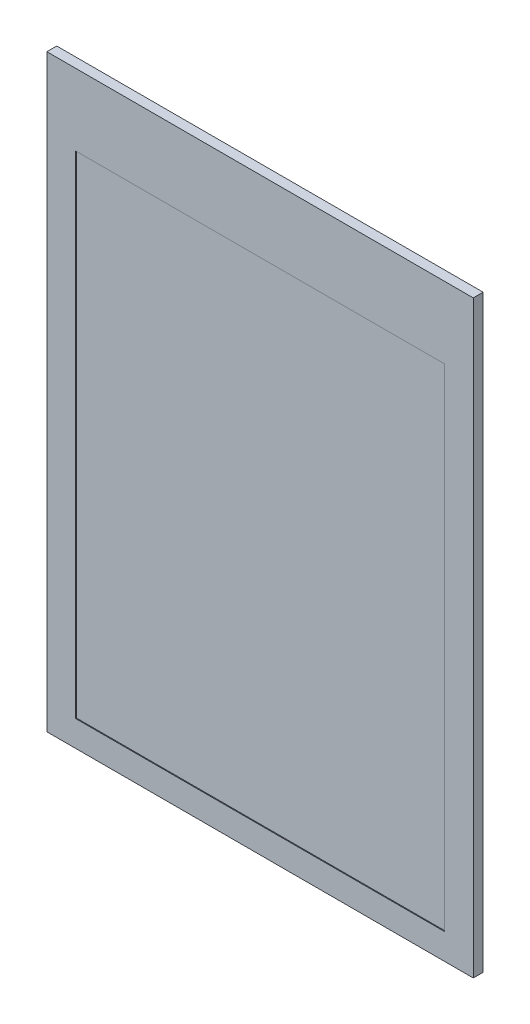
ISO-10303-21;
HEADER;
FILE_DESCRIPTION(('STEP AP214'),'2;1');
FILE_NAME('part.step','',(''),(''),'','','');
FILE_SCHEMA(('AUTOMOTIVE_DESIGN { 1 0 10303 214 1 1 1 1 }'));
ENDSEC;
DATA;
#1=APPLICATION_CONTEXT('core data for automotive mechanical design processes');
#2=APPLICATION_PROTOCOL_DEFINITION('international standard','automotive_design',2000,#1);
#3=PRODUCT_CONTEXT('',#1,'mechanical');
#4=PRODUCT('Part','Part','',(#3));
#5=PRODUCT_RELATED_PRODUCT_CATEGORY('part','',(#4));
#6=PRODUCT_DEFINITION_FORMATION('','',#4);
#7=PRODUCT_DEFINITION_CONTEXT('part definition',#1,'design');
#8=PRODUCT_DEFINITION('design','',#6,#7);
#9=PRODUCT_DEFINITION_SHAPE('','',#8);
#10=(LENGTH_UNIT() NAMED_UNIT(*) SI_UNIT(.MILLI.,.METRE.));
#11=(NAMED_UNIT(*) PLANE_ANGLE_UNIT() SI_UNIT($,.RADIAN.));
#12=(NAMED_UNIT(*) SI_UNIT($,.STERADIAN.) SOLID_ANGLE_UNIT());
#13=UNCERTAINTY_MEASURE_WITH_UNIT(LENGTH_MEASURE(1.E-05),#10,'distance_accuracy_value','');
#14=(GEOMETRIC_REPRESENTATION_CONTEXT(3) GLOBAL_UNCERTAINTY_ASSIGNED_CONTEXT((#13)) GLOBAL_UNIT_ASSIGNED_CONTEXT((#10,
#11,#12)) REPRESENTATION_CONTEXT('',''));
#15=CARTESIAN_POINT('',(0.,0.,0.));
#16=DIRECTION('',(0.,0.,1.));
#17=DIRECTION('',(1.,0.,0.));
#18=AXIS2_PLACEMENT_3D('',#15,#16,#17);
#19=CARTESIAN_POINT('',(0.,0.,8.79254994989176));
#20=DIRECTION('',(0.,0.,-1.));
#21=DIRECTION('',(-1.,0.,0.));
#22=AXIS2_PLACEMENT_3D('',#19,#20,#21);
#23=PLANE('',#22);
#24=DIRECTION('',(0.,1.,0.));
#25=VECTOR('',#24,1.);
#26=CARTESIAN_POINT('',(27.2379834308576,-26.9221947705403,8.79254994989176));
#27=LINE('',#26,#25);
#28=CARTESIAN_POINT('',(27.2379834308576,-95.9339947705403,8.79254994989176));
#29=VERTEX_POINT('',#28);
#30=CARTESIAN_POINT('',(27.2379834308576,-26.9221947705403,8.79254994989176));
#31=VERTEX_POINT('',#30);
#32=EDGE_CURVE('E143',#29,#31,#27,.T.);
#33=ORIENTED_EDGE('',*,*,#32,.F.);
#34=DIRECTION('',(1.,0.,0.));
#35=VECTOR('',#34,1.);
#36=CARTESIAN_POINT('',(27.2379834308576,-95.9339947705403,8.79254994989176));
#37=LINE('',#36,#35);
#38=CARTESIAN_POINT('',(-22.7238165691424,-95.9339947705403,8.79254994989176));
#39=VERTEX_POINT('',#38);
#40=EDGE_CURVE('E159',#39,#29,#37,.T.);
#41=ORIENTED_EDGE('',*,*,#40,.F.);
#42=DIRECTION('',(0.,-1.,0.));
#43=VECTOR('',#42,1.);
#44=CARTESIAN_POINT('',(-22.7238165691424,-26.9221947705403,8.79254994989176));
#45=LINE('',#44,#43);
#46=CARTESIAN_POINT('',(-22.7238165691424,-26.9221947705403,8.79254994989176));
#47=VERTEX_POINT('',#46);
#48=EDGE_CURVE('E156',#47,#39,#45,.T.);
#49=ORIENTED_EDGE('',*,*,#48,.F.);
#50=DIRECTION('',(-1.,0.,0.));
#51=VECTOR('',#50,1.);
#52=CARTESIAN_POINT('',(27.2379834308576,-26.9221947705403,8.79254994989176));
#53=LINE('',#52,#51);
#54=EDGE_CURVE('E153',#31,#47,#53,.T.);
#55=ORIENTED_EDGE('',*,*,#54,.F.);
#56=EDGE_LOOP('',(#33,#41,#49,#55));
#57=FACE_BOUND('',#56,.T.);
#58=ADVANCED_FACE('F42',(#57),#23,.T.);
#59=CARTESIAN_POINT('',(27.2379834308576,-95.9339947705403,100.647800165021));
#60=DIRECTION('',(0.,1.,0.));
#61=DIRECTION('',(0.,0.,1.));
#62=AXIS2_PLACEMENT_3D('',#59,#60,#61);
#63=PLANE('',#62);
#64=DIRECTION('',(0.,0.,-1.));
#65=VECTOR('',#64,1.);
#66=CARTESIAN_POINT('',(27.2379834308576,-95.9339947705403,100.647800165021));
#67=LINE('',#66,#65);
#68=CARTESIAN_POINT('',(27.2379834308576,-95.9339947705403,9.94914994989177));
#69=VERTEX_POINT('',#68);
#70=EDGE_CURVE('E162',#69,#29,#67,.T.);
#71=ORIENTED_EDGE('',*,*,#70,.F.);
#72=DIRECTION('',(-1.,0.,0.));
#73=VECTOR('',#72,1.);
#74=CARTESIAN_POINT('',(27.2379834308576,-95.9339947705403,9.94914994989177));
#75=LINE('',#74,#73);
#76=CARTESIAN_POINT('',(-22.7238165691424,-95.9339947705403,9.94914994989177));
#77=VERTEX_POINT('',#76);
#78=EDGE_CURVE('E46',#69,#77,#75,.T.);
#79=ORIENTED_EDGE('',*,*,#78,.T.);
#80=DIRECTION('',(0.,0.,-1.));
#81=VECTOR('',#80,1.);
#82=CARTESIAN_POINT('',(-22.7238165691424,-95.9339947705403,100.647800165021));
#83=LINE('',#82,#81);
#84=EDGE_CURVE('E164',#77,#39,#83,.T.);
#85=ORIENTED_EDGE('',*,*,#84,.T.);
#86=ORIENTED_EDGE('',*,*,#40,.T.);
#87=EDGE_LOOP('',(#71,#79,#85,#86));
#88=FACE_BOUND('',#87,.T.);
#89=ADVANCED_FACE('F174',(#88),#63,.F.);
#90=CARTESIAN_POINT('',(-22.7238165691424,-26.9221947705403,100.647800165021));
#91=DIRECTION('',(1.,0.,0.));
#92=DIRECTION('',(0.,0.,-1.));
#93=AXIS2_PLACEMENT_3D('',#90,#91,#92);
#94=PLANE('',#93);
#95=ORIENTED_EDGE('',*,*,#84,.F.);
#96=DIRECTION('',(0.,1.,0.));
#97=VECTOR('',#96,1.);
#98=CARTESIAN_POINT('',(-22.7238165691424,-26.9221947705403,9.94914994989177));
#99=LINE('',#98,#97);
#100=CARTESIAN_POINT('',(-22.7238165691424,-26.9221947705403,9.94914994989177));
#101=VERTEX_POINT('',#100);
#102=EDGE_CURVE('E147',#77,#101,#99,.T.);
#103=ORIENTED_EDGE('',*,*,#102,.T.);
#104=DIRECTION('',(0.,0.,-1.));
#105=VECTOR('',#104,1.);
#106=CARTESIAN_POINT('',(-22.7238165691424,-26.9221947705403,100.647800165021));
#107=LINE('',#106,#105);
#108=EDGE_CURVE('E166',#101,#47,#107,.T.);
#109=ORIENTED_EDGE('',*,*,#108,.T.);
#110=ORIENTED_EDGE('',*,*,#48,.T.);
#111=EDGE_LOOP('',(#95,#103,#109,#110));
#112=FACE_BOUND('',#111,.T.);
#113=ADVANCED_FACE('F182',(#112),#94,.F.);
#114=CARTESIAN_POINT('',(27.2379834308576,-26.9221947705403,100.647800165021));
#115=DIRECTION('',(0.,-1.,0.));
#116=DIRECTION('',(0.,0.,-1.));
#117=AXIS2_PLACEMENT_3D('',#114,#115,#116);
#118=PLANE('',#117);
#119=ORIENTED_EDGE('',*,*,#108,.F.);
#120=DIRECTION('',(1.,0.,0.));
#121=VECTOR('',#120,1.);
#122=CARTESIAN_POINT('',(27.2379834308576,-26.9221947705403,9.94914994989177));
#123=LINE('',#122,#121);
#124=CARTESIAN_POINT('',(27.2379834308576,-26.9221947705403,9.94914994989177));
#125=VERTEX_POINT('',#124);
#126=EDGE_CURVE('E51',#101,#125,#123,.T.);
#127=ORIENTED_EDGE('',*,*,#126,.T.);
#128=DIRECTION('',(0.,0.,-1.));
#129=VECTOR('',#128,1.);
#130=CARTESIAN_POINT('',(27.2379834308576,-26.9221947705403,100.647800165021));
#131=LINE('',#130,#129);
#132=EDGE_CURVE('E167',#125,#31,#131,.T.);
#133=ORIENTED_EDGE('',*,*,#132,.T.);
#134=ORIENTED_EDGE('',*,*,#54,.T.);
#135=EDGE_LOOP('',(#119,#127,#133,#134));
#136=FACE_BOUND('',#135,.T.);
#137=ADVANCED_FACE('F179',(#136),#118,.F.);
#138=CARTESIAN_POINT('',(27.2379834308576,-26.9221947705403,100.647800165021));
#139=DIRECTION('',(-1.,0.,0.));
#140=DIRECTION('',(0.,0.,1.));
#141=AXIS2_PLACEMENT_3D('',#138,#139,#140);
#142=PLANE('',#141);
#143=ORIENTED_EDGE('',*,*,#132,.F.);
#144=DIRECTION('',(0.,-1.,0.));
#145=VECTOR('',#144,1.);
#146=CARTESIAN_POINT('',(27.2379834308576,-26.9221947705403,9.94914994989177));
#147=LINE('',#146,#145);
#148=EDGE_CURVE('E11',#125,#69,#147,.T.);
#149=ORIENTED_EDGE('',*,*,#148,.T.);
#150=ORIENTED_EDGE('',*,*,#70,.T.);
#151=ORIENTED_EDGE('',*,*,#32,.T.);
#152=EDGE_LOOP('',(#143,#149,#150,#151));
#153=FACE_BOUND('',#152,.T.);
#154=ADVANCED_FACE('F44',(#153),#142,.F.);
#155=CARTESIAN_POINT('',(2.31414750123804,-59.1293947705402,9.94914994989176));
#156=DIRECTION('',(0.,0.,-1.));
#157=DIRECTION('',(-1.,0.,0.));
#158=AXIS2_PLACEMENT_3D('',#155,#156,#157);
#159=PLANE('',#158);
#160=DIRECTION('',(-1.,0.,0.));
#161=VECTOR('',#160,1.);
#162=CARTESIAN_POINT('',(23.8568706207472,-35.3041522131008,9.94914994989176));
#163=LINE('',#162,#161);
#164=CARTESIAN_POINT('',(23.8568706207472,-35.3041522131008,9.94914994989176));
#165=VERTEX_POINT('',#164);
#166=CARTESIAN_POINT('',(-19.3428767716694,-35.3041522131008,9.94914994989176));
#167=VERTEX_POINT('',#166);
#168=EDGE_CURVE('E137',#165,#167,#163,.T.);
#169=ORIENTED_EDGE('',*,*,#168,.F.);
#170=DIRECTION('',(0.,1.,0.));
#171=VECTOR('',#170,1.);
#172=CARTESIAN_POINT('',(23.8568706207472,-35.3041522131008,9.94914994989176));
#173=LINE('',#172,#171);
#174=CARTESIAN_POINT('',(23.8568706207472,-92.9039474280174,9.94914994989176));
#175=VERTEX_POINT('',#174);
#176=EDGE_CURVE('E59',#175,#165,#173,.T.);
#177=ORIENTED_EDGE('',*,*,#176,.F.);
#178=DIRECTION('',(1.,0.,0.));
#179=VECTOR('',#178,1.);
#180=CARTESIAN_POINT('',(23.8568706207472,-92.9039474280174,9.94914994989176));
#181=LINE('',#180,#179);
#182=CARTESIAN_POINT('',(-19.3428767716694,-92.9039474280174,9.94914994989176));
#183=VERTEX_POINT('',#182);
#184=EDGE_CURVE('E128',#183,#175,#181,.T.);
#185=ORIENTED_EDGE('',*,*,#184,.F.);
#186=DIRECTION('',(0.,-1.,0.));
#187=VECTOR('',#186,1.);
#188=CARTESIAN_POINT('',(-19.3428767716694,-35.3041522131008,9.94914994989176));
#189=LINE('',#188,#187);
#190=EDGE_CURVE('E131',#167,#183,#189,.T.);
#191=ORIENTED_EDGE('',*,*,#190,.F.);
#192=EDGE_LOOP('',(#169,#177,#185,#191));
#193=FACE_BOUND('',#192,.T.);
#194=ORIENTED_EDGE('',*,*,#126,.F.);
#195=ORIENTED_EDGE('',*,*,#102,.F.);
#196=ORIENTED_EDGE('',*,*,#78,.F.);
#197=ORIENTED_EDGE('',*,*,#148,.F.);
#198=EDGE_LOOP('',(#194,#195,#196,#197));
#199=FACE_BOUND('',#198,.T.);
#200=ADVANCED_FACE('F176',(#193,#199),#159,.F.);
#201=CARTESIAN_POINT('',(23.8568706207472,-35.3041522131008,9.84914994989176));
#202=DIRECTION('',(1.,0.,0.));
#203=DIRECTION('',(0.,0.,-1.));
#204=AXIS2_PLACEMENT_3D('',#201,#202,#203);
#205=PLANE('',#204);
#206=ORIENTED_EDGE('',*,*,#176,.T.);
#207=DIRECTION('',(0.,0.,1.));
#208=VECTOR('',#207,1.);
#209=CARTESIAN_POINT('',(23.8568706207472,-35.3041522131008,9.84914994989176));
#210=LINE('',#209,#208);
#211=CARTESIAN_POINT('',(23.8568706207472,-35.3041522131008,9.84914994989176));
#212=VERTEX_POINT('',#211);
#213=EDGE_CURVE('E106',#212,#165,#210,.T.);
#214=ORIENTED_EDGE('',*,*,#213,.F.);
#215=DIRECTION('',(0.,1.,0.));
#216=VECTOR('',#215,1.);
#217=CARTESIAN_POINT('',(23.8568706207472,-35.3041522131008,9.84914994989176));
#218=LINE('',#217,#216);
#219=CARTESIAN_POINT('',(23.8568706207472,-92.9039474280174,9.84914994989176));
#220=VERTEX_POINT('',#219);
#221=EDGE_CURVE('E110',#220,#212,#218,.T.);
#222=ORIENTED_EDGE('',*,*,#221,.F.);
#223=DIRECTION('',(0.,0.,1.));
#224=VECTOR('',#223,1.);
#225=CARTESIAN_POINT('',(23.8568706207472,-92.9039474280174,9.84914994989176));
#226=LINE('',#225,#224);
#227=EDGE_CURVE('E141',#220,#175,#226,.T.);
#228=ORIENTED_EDGE('',*,*,#227,.T.);
#229=EDGE_LOOP('',(#206,#214,#222,#228));
#230=FACE_BOUND('',#229,.T.);
#231=ADVANCED_FACE('F108',(#230),#205,.F.);
#232=CARTESIAN_POINT('',(23.8568706207472,-92.9039474280174,9.84914994989176));
#233=DIRECTION('',(0.,-1.,0.));
#234=DIRECTION('',(0.,0.,-1.));
#235=AXIS2_PLACEMENT_3D('',#232,#233,#234);
#236=PLANE('',#235);
#237=ORIENTED_EDGE('',*,*,#184,.T.);
#238=ORIENTED_EDGE('',*,*,#227,.F.);
#239=DIRECTION('',(1.,0.,0.));
#240=VECTOR('',#239,1.);
#241=CARTESIAN_POINT('',(23.8568706207472,-92.9039474280174,9.84914994989176));
#242=LINE('',#241,#240);
#243=CARTESIAN_POINT('',(-19.3428767716694,-92.9039474280174,9.84914994989176));
#244=VERTEX_POINT('',#243);
#245=EDGE_CURVE('E116',#244,#220,#242,.T.);
#246=ORIENTED_EDGE('',*,*,#245,.F.);
#247=DIRECTION('',(0.,0.,1.));
#248=VECTOR('',#247,1.);
#249=CARTESIAN_POINT('',(-19.3428767716694,-92.9039474280174,9.84914994989176));
#250=LINE('',#249,#248);
#251=EDGE_CURVE('E144',#244,#183,#250,.T.);
#252=ORIENTED_EDGE('',*,*,#251,.T.);
#253=EDGE_LOOP('',(#237,#238,#246,#252));
#254=FACE_BOUND('',#253,.T.);
#255=ADVANCED_FACE('F206',(#254),#236,.F.);
#256=CARTESIAN_POINT('',(-19.3428767716694,-35.3041522131008,9.84914994989176));
#257=DIRECTION('',(-1.,0.,0.));
#258=DIRECTION('',(0.,0.,1.));
#259=AXIS2_PLACEMENT_3D('',#256,#257,#258);
#260=PLANE('',#259);
#261=ORIENTED_EDGE('',*,*,#190,.T.);
#262=ORIENTED_EDGE('',*,*,#251,.F.);
#263=DIRECTION('',(0.,-1.,0.));
#264=VECTOR('',#263,1.);
#265=CARTESIAN_POINT('',(-19.3428767716694,-35.3041522131008,9.84914994989176));
#266=LINE('',#265,#264);
#267=CARTESIAN_POINT('',(-19.3428767716694,-35.3041522131008,9.84914994989176));
#268=VERTEX_POINT('',#267);
#269=EDGE_CURVE('E124',#268,#244,#266,.T.);
#270=ORIENTED_EDGE('',*,*,#269,.F.);
#271=DIRECTION('',(0.,0.,1.));
#272=VECTOR('',#271,1.);
#273=CARTESIAN_POINT('',(-19.3428767716694,-35.3041522131008,9.84914994989176));
#274=LINE('',#273,#272);
#275=EDGE_CURVE('E115',#268,#167,#274,.T.);
#276=ORIENTED_EDGE('',*,*,#275,.T.);
#277=EDGE_LOOP('',(#261,#262,#270,#276));
#278=FACE_BOUND('',#277,.T.);
#279=ADVANCED_FACE('F210',(#278),#260,.F.);
#280=CARTESIAN_POINT('',(23.8568706207472,-35.3041522131008,9.84914994989176));
#281=DIRECTION('',(0.,1.,0.));
#282=DIRECTION('',(0.,0.,1.));
#283=AXIS2_PLACEMENT_3D('',#280,#281,#282);
#284=PLANE('',#283);
#285=ORIENTED_EDGE('',*,*,#168,.T.);
#286=ORIENTED_EDGE('',*,*,#275,.F.);
#287=DIRECTION('',(-1.,0.,0.));
#288=VECTOR('',#287,1.);
#289=CARTESIAN_POINT('',(23.8568706207472,-35.3041522131008,9.84914994989176));
#290=LINE('',#289,#288);
#291=EDGE_CURVE('E119',#212,#268,#290,.T.);
#292=ORIENTED_EDGE('',*,*,#291,.F.);
#293=ORIENTED_EDGE('',*,*,#213,.T.);
#294=EDGE_LOOP('',(#285,#286,#292,#293));
#295=FACE_BOUND('',#294,.T.);
#296=ADVANCED_FACE('F120',(#295),#284,.F.);
#297=CARTESIAN_POINT('',(0.,0.,9.84914994989176));
#298=DIRECTION('',(0.,0.,-1.));
#299=DIRECTION('',(-1.,0.,0.));
#300=AXIS2_PLACEMENT_3D('',#297,#298,#299);
#301=PLANE('',#300);
#302=ORIENTED_EDGE('',*,*,#221,.T.);
#303=ORIENTED_EDGE('',*,*,#291,.T.);
#304=ORIENTED_EDGE('',*,*,#269,.T.);
#305=ORIENTED_EDGE('',*,*,#245,.T.);
#306=EDGE_LOOP('',(#302,#303,#304,#305));
#307=FACE_BOUND('',#306,.T.);
#308=ADVANCED_FACE('F126',(#307),#301,.F.);
#309=CLOSED_SHELL('',(#58,#89,#113,#137,#154,#200,#231,#255,#279,#296,#308));
#310=MANIFOLD_SOLID_BREP('B2',#309);
#311=ADVANCED_BREP_SHAPE_REPRESENTATION('',(#18,#310),#14);
#312=SHAPE_DEFINITION_REPRESENTATION(#9,#311);
ENDSEC;
END-ISO-10303-21;
